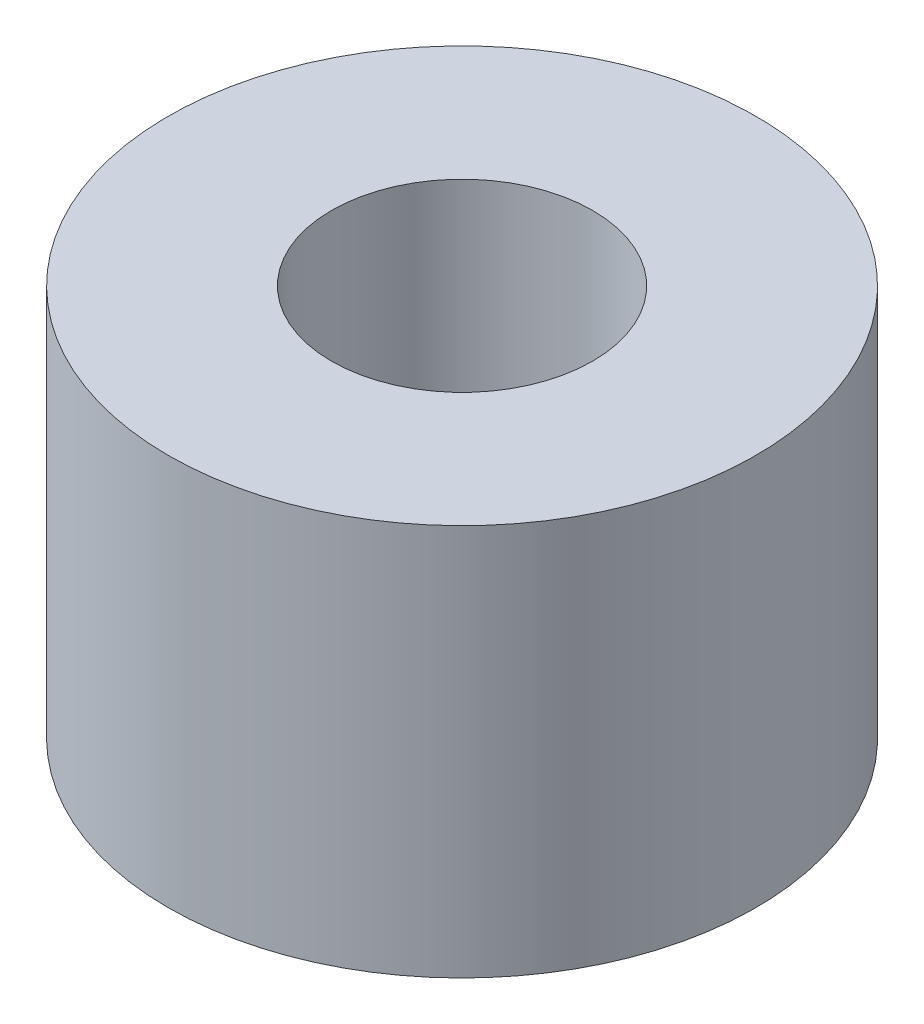
ISO-10303-21;
HEADER;
FILE_DESCRIPTION(('STEP AP214'),'2;1');
FILE_NAME('part.step','',(''),(''),'','','');
FILE_SCHEMA(('AUTOMOTIVE_DESIGN { 1 0 10303 214 1 1 1 1 }'));
ENDSEC;
DATA;
#1=APPLICATION_CONTEXT('core data for automotive mechanical design processes');
#2=APPLICATION_PROTOCOL_DEFINITION('international standard','automotive_design',2000,#1);
#3=PRODUCT_CONTEXT('',#1,'mechanical');
#4=PRODUCT('Part','Part','',(#3));
#5=PRODUCT_RELATED_PRODUCT_CATEGORY('part','',(#4));
#6=PRODUCT_DEFINITION_FORMATION('','',#4);
#7=PRODUCT_DEFINITION_CONTEXT('part definition',#1,'design');
#8=PRODUCT_DEFINITION('design','',#6,#7);
#9=PRODUCT_DEFINITION_SHAPE('','',#8);
#10=(LENGTH_UNIT() NAMED_UNIT(*) SI_UNIT(.MILLI.,.METRE.));
#11=(NAMED_UNIT(*) PLANE_ANGLE_UNIT() SI_UNIT($,.RADIAN.));
#12=(NAMED_UNIT(*) SI_UNIT($,.STERADIAN.) SOLID_ANGLE_UNIT());
#13=UNCERTAINTY_MEASURE_WITH_UNIT(LENGTH_MEASURE(1.E-05),#10,'distance_accuracy_value','');
#14=(GEOMETRIC_REPRESENTATION_CONTEXT(3) GLOBAL_UNCERTAINTY_ASSIGNED_CONTEXT((#13)) GLOBAL_UNIT_ASSIGNED_CONTEXT((#10,
#11,#12)) REPRESENTATION_CONTEXT('',''));
#15=CARTESIAN_POINT('',(0.,0.,0.));
#16=DIRECTION('',(0.,0.,1.));
#17=DIRECTION('',(1.,0.,0.));
#18=AXIS2_PLACEMENT_3D('',#15,#16,#17);
#19=CARTESIAN_POINT('',(0.,7.62,0.));
#20=DIRECTION('',(0.,1.,0.));
#21=DIRECTION('',(0.,0.,1.));
#22=AXIS2_PLACEMENT_3D('',#19,#20,#21);
#23=PLANE('',#22);
#24=CARTESIAN_POINT('',(0.,7.62,0.));
#25=DIRECTION('',(0.,1.,0.));
#26=DIRECTION('',(0.,0.,1.));
#27=AXIS2_PLACEMENT_3D('',#24,#25,#26);
#28=CIRCLE('',#27,5.715);
#29=CARTESIAN_POINT('',(0.,7.62,5.715));
#30=VERTEX_POINT('',#29);
#31=EDGE_CURVE('E10',#30,#30,#28,.T.);
#32=ORIENTED_EDGE('',*,*,#31,.T.);
#33=EDGE_LOOP('',(#32));
#34=FACE_BOUND('',#33,.T.);
#35=CARTESIAN_POINT('',(0.,7.62,0.));
#36=DIRECTION('',(0.,1.,0.));
#37=DIRECTION('',(0.,0.,1.));
#38=AXIS2_PLACEMENT_3D('',#35,#36,#37);
#39=CIRCLE('',#38,2.54);
#40=CARTESIAN_POINT('',(0.,7.62,2.54));
#41=VERTEX_POINT('',#40);
#42=EDGE_CURVE('E50',#41,#41,#39,.T.);
#43=ORIENTED_EDGE('',*,*,#42,.F.);
#44=EDGE_LOOP('',(#43));
#45=FACE_BOUND('',#44,.T.);
#46=ADVANCED_FACE('F37',(#34,#45),#23,.T.);
#47=CARTESIAN_POINT('',(0.,0.,0.));
#48=DIRECTION('',(0.,1.,0.));
#49=DIRECTION('',(0.,0.,1.));
#50=AXIS2_PLACEMENT_3D('',#47,#48,#49);
#51=PLANE('',#50);
#52=CARTESIAN_POINT('',(0.,0.,0.));
#53=DIRECTION('',(0.,1.,0.));
#54=DIRECTION('',(0.,0.,1.));
#55=AXIS2_PLACEMENT_3D('',#52,#53,#54);
#56=CIRCLE('',#55,5.715);
#57=CARTESIAN_POINT('',(0.,0.,5.715));
#58=VERTEX_POINT('',#57);
#59=EDGE_CURVE('E41',#58,#58,#56,.T.);
#60=ORIENTED_EDGE('',*,*,#59,.F.);
#61=EDGE_LOOP('',(#60));
#62=FACE_BOUND('',#61,.T.);
#63=CARTESIAN_POINT('',(0.,0.,0.));
#64=DIRECTION('',(0.,1.,0.));
#65=DIRECTION('',(0.,0.,1.));
#66=AXIS2_PLACEMENT_3D('',#63,#64,#65);
#67=CIRCLE('',#66,2.54);
#68=CARTESIAN_POINT('',(0.,0.,2.54));
#69=VERTEX_POINT('',#68);
#70=EDGE_CURVE('E52',#69,#69,#67,.T.);
#71=ORIENTED_EDGE('',*,*,#70,.T.);
#72=EDGE_LOOP('',(#71));
#73=FACE_BOUND('',#72,.T.);
#74=ADVANCED_FACE('F64',(#62,#73),#51,.F.);
#75=CARTESIAN_POINT('',(0.,7.62,0.));
#76=DIRECTION('',(0.,-1.,0.));
#77=DIRECTION('',(0.,0.,-1.));
#78=AXIS2_PLACEMENT_3D('',#75,#76,#77);
#79=CYLINDRICAL_SURFACE('',#78,5.715);
#80=ORIENTED_EDGE('',*,*,#31,.F.);
#81=EDGE_LOOP('',(#80));
#82=FACE_BOUND('',#81,.T.);
#83=ORIENTED_EDGE('',*,*,#59,.T.);
#84=EDGE_LOOP('',(#83));
#85=FACE_BOUND('',#84,.T.);
#86=ADVANCED_FACE('F39',(#82,#85),#79,.T.);
#87=CARTESIAN_POINT('',(0.,7.62,0.));
#88=DIRECTION('',(0.,-1.,0.));
#89=DIRECTION('',(0.,0.,-1.));
#90=AXIS2_PLACEMENT_3D('',#87,#88,#89);
#91=CYLINDRICAL_SURFACE('',#90,2.54);
#92=ORIENTED_EDGE('',*,*,#42,.T.);
#93=EDGE_LOOP('',(#92));
#94=FACE_BOUND('',#93,.T.);
#95=ORIENTED_EDGE('',*,*,#70,.F.);
#96=EDGE_LOOP('',(#95));
#97=FACE_BOUND('',#96,.T.);
#98=ADVANCED_FACE('F60',(#94,#97),#91,.F.);
#99=CLOSED_SHELL('',(#46,#74,#86,#98));
#100=MANIFOLD_SOLID_BREP('B2',#99);
#101=ADVANCED_BREP_SHAPE_REPRESENTATION('',(#18,#100),#14);
#102=SHAPE_DEFINITION_REPRESENTATION(#9,#101);
ENDSEC;
END-ISO-10303-21;
